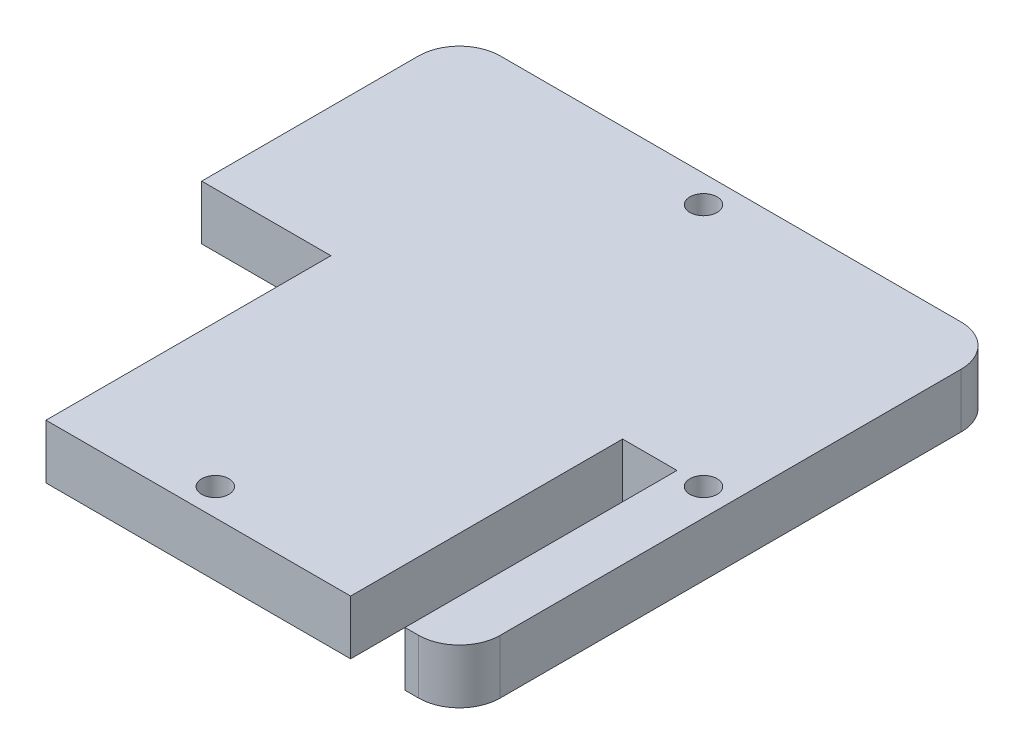
ISO-10303-21;
HEADER;
FILE_DESCRIPTION(('STEP AP214'),'2;1');
FILE_NAME('part.step','',(''),(''),'','','');
FILE_SCHEMA(('AUTOMOTIVE_DESIGN { 1 0 10303 214 1 1 1 1 }'));
ENDSEC;
DATA;
#1=APPLICATION_CONTEXT('core data for automotive mechanical design processes');
#2=APPLICATION_PROTOCOL_DEFINITION('international standard','automotive_design',2000,#1);
#3=PRODUCT_CONTEXT('',#1,'mechanical');
#4=PRODUCT('Part','Part','',(#3));
#5=PRODUCT_RELATED_PRODUCT_CATEGORY('part','',(#4));
#6=PRODUCT_DEFINITION_FORMATION('','',#4);
#7=PRODUCT_DEFINITION_CONTEXT('part definition',#1,'design');
#8=PRODUCT_DEFINITION('design','',#6,#7);
#9=PRODUCT_DEFINITION_SHAPE('','',#8);
#10=(LENGTH_UNIT() NAMED_UNIT(*) SI_UNIT(.MILLI.,.METRE.));
#11=(NAMED_UNIT(*) PLANE_ANGLE_UNIT() SI_UNIT($,.RADIAN.));
#12=(NAMED_UNIT(*) SI_UNIT($,.STERADIAN.) SOLID_ANGLE_UNIT());
#13=UNCERTAINTY_MEASURE_WITH_UNIT(LENGTH_MEASURE(1.E-05),#10,'distance_accuracy_value','');
#14=(GEOMETRIC_REPRESENTATION_CONTEXT(3) GLOBAL_UNCERTAINTY_ASSIGNED_CONTEXT((#13)) GLOBAL_UNIT_ASSIGNED_CONTEXT((#10,
#11,#12)) REPRESENTATION_CONTEXT('',''));
#15=CARTESIAN_POINT('',(0.,0.,0.));
#16=DIRECTION('',(0.,0.,1.));
#17=DIRECTION('',(1.,0.,0.));
#18=AXIS2_PLACEMENT_3D('',#15,#16,#17);
#19=CARTESIAN_POINT('',(0.,2.,19.95));
#20=DIRECTION('',(0.,0.,-1.));
#21=DIRECTION('',(-1.,0.,0.));
#22=AXIS2_PLACEMENT_3D('',#19,#20,#21);
#23=PLANE('',#22);
#24=DIRECTION('',(1.,0.,0.));
#25=VECTOR('',#24,1.);
#26=CARTESIAN_POINT('',(0.,-2.,19.95));
#27=LINE('',#26,#25);
#28=CARTESIAN_POINT('',(15.95,-2.,19.95));
#29=VERTEX_POINT('',#28);
#30=CARTESIAN_POINT('',(16.95,-2.,19.95));
#31=VERTEX_POINT('',#30);
#32=EDGE_CURVE('E171',#29,#31,#27,.T.);
#33=ORIENTED_EDGE('',*,*,#32,.T.);
#34=DIRECTION('',(0.,-1.,0.));
#35=VECTOR('',#34,1.);
#36=CARTESIAN_POINT('',(16.95,2.,19.95));
#37=LINE('',#36,#35);
#38=CARTESIAN_POINT('',(16.95,2.,19.95));
#39=VERTEX_POINT('',#38);
#40=EDGE_CURVE('E11',#31,#39,#37,.F.);
#41=ORIENTED_EDGE('',*,*,#40,.T.);
#42=DIRECTION('',(1.,0.,0.));
#43=VECTOR('',#42,1.);
#44=CARTESIAN_POINT('',(0.,2.,19.95));
#45=LINE('',#44,#43);
#46=CARTESIAN_POINT('',(15.95,2.,19.95));
#47=VERTEX_POINT('',#46);
#48=EDGE_CURVE('E250',#47,#39,#45,.T.);
#49=ORIENTED_EDGE('',*,*,#48,.F.);
#50=DIRECTION('',(0.,1.,0.));
#51=VECTOR('',#50,1.);
#52=CARTESIAN_POINT('',(15.95,-2.,19.95));
#53=LINE('',#52,#51);
#54=EDGE_CURVE('E245',#29,#47,#53,.T.);
#55=ORIENTED_EDGE('',*,*,#54,.F.);
#56=EDGE_LOOP('',(#33,#41,#49,#55));
#57=FACE_BOUND('',#56,.T.);
#58=ADVANCED_FACE('F49',(#57),#23,.F.);
#59=CARTESIAN_POINT('',(19.95,2.,0.));
#60=DIRECTION('',(1.,0.,0.));
#61=DIRECTION('',(0.,0.,-1.));
#62=AXIS2_PLACEMENT_3D('',#59,#60,#61);
#63=PLANE('',#62);
#64=DIRECTION('',(0.,0.,1.));
#65=VECTOR('',#64,1.);
#66=CARTESIAN_POINT('',(19.95,-2.,0.));
#67=LINE('',#66,#65);
#68=CARTESIAN_POINT('',(19.95,-2.,-16.95));
#69=VERTEX_POINT('',#68);
#70=CARTESIAN_POINT('',(19.95,-2.,16.95));
#71=VERTEX_POINT('',#70);
#72=EDGE_CURVE('E242',#69,#71,#67,.T.);
#73=ORIENTED_EDGE('',*,*,#72,.F.);
#74=DIRECTION('',(0.,-1.,0.));
#75=VECTOR('',#74,1.);
#76=CARTESIAN_POINT('',(19.95,2.,-16.95));
#77=LINE('',#76,#75);
#78=CARTESIAN_POINT('',(19.95,2.,-16.95));
#79=VERTEX_POINT('',#78);
#80=EDGE_CURVE('E217',#69,#79,#77,.F.);
#81=ORIENTED_EDGE('',*,*,#80,.T.);
#82=DIRECTION('',(0.,0.,1.));
#83=VECTOR('',#82,1.);
#84=CARTESIAN_POINT('',(19.95,2.,0.));
#85=LINE('',#84,#83);
#86=CARTESIAN_POINT('',(19.95,2.,16.95));
#87=VERTEX_POINT('',#86);
#88=EDGE_CURVE('E170',#79,#87,#85,.T.);
#89=ORIENTED_EDGE('',*,*,#88,.T.);
#90=DIRECTION('',(0.,-1.,0.));
#91=VECTOR('',#90,1.);
#92=CARTESIAN_POINT('',(19.95,-2.,16.95));
#93=LINE('',#92,#91);
#94=EDGE_CURVE('E213',#87,#71,#93,.T.);
#95=ORIENTED_EDGE('',*,*,#94,.T.);
#96=EDGE_LOOP('',(#73,#81,#89,#95));
#97=FACE_BOUND('',#96,.T.);
#98=ADVANCED_FACE('F325',(#97),#63,.T.);
#99=CARTESIAN_POINT('',(0.,2.,-19.95));
#100=DIRECTION('',(0.,0.,-1.));
#101=DIRECTION('',(-1.,0.,0.));
#102=AXIS2_PLACEMENT_3D('',#99,#100,#101);
#103=PLANE('',#102);
#104=DIRECTION('',(1.,0.,0.));
#105=VECTOR('',#104,1.);
#106=CARTESIAN_POINT('',(0.,2.,-19.95));
#107=LINE('',#106,#105);
#108=CARTESIAN_POINT('',(-16.95,2.,-19.95));
#109=VERTEX_POINT('',#108);
#110=CARTESIAN_POINT('',(16.95,2.,-19.95));
#111=VERTEX_POINT('',#110);
#112=EDGE_CURVE('E176',#109,#111,#107,.T.);
#113=ORIENTED_EDGE('',*,*,#112,.T.);
#114=DIRECTION('',(0.,-1.,0.));
#115=VECTOR('',#114,1.);
#116=CARTESIAN_POINT('',(16.95,2.,-19.95));
#117=LINE('',#116,#115);
#118=CARTESIAN_POINT('',(16.95,-2.,-19.95));
#119=VERTEX_POINT('',#118);
#120=EDGE_CURVE('E200',#111,#119,#117,.T.);
#121=ORIENTED_EDGE('',*,*,#120,.T.);
#122=DIRECTION('',(1.,0.,0.));
#123=VECTOR('',#122,1.);
#124=CARTESIAN_POINT('',(0.,-2.,-19.95));
#125=LINE('',#124,#123);
#126=CARTESIAN_POINT('',(-16.95,-2.,-19.95));
#127=VERTEX_POINT('',#126);
#128=EDGE_CURVE('E240',#127,#119,#125,.T.);
#129=ORIENTED_EDGE('',*,*,#128,.F.);
#130=DIRECTION('',(0.,-1.,0.));
#131=VECTOR('',#130,1.);
#132=CARTESIAN_POINT('',(-16.95,2.,-19.95));
#133=LINE('',#132,#131);
#134=EDGE_CURVE('E197',#127,#109,#133,.F.);
#135=ORIENTED_EDGE('',*,*,#134,.T.);
#136=EDGE_LOOP('',(#113,#121,#129,#135));
#137=FACE_BOUND('',#136,.T.);
#138=ADVANCED_FACE('F332',(#137),#103,.T.);
#139=CARTESIAN_POINT('',(-19.95,2.,0.));
#140=DIRECTION('',(1.,0.,0.));
#141=DIRECTION('',(0.,0.,-1.));
#142=AXIS2_PLACEMENT_3D('',#139,#140,#141);
#143=PLANE('',#142);
#144=DIRECTION('',(0.,0.,1.));
#145=VECTOR('',#144,1.);
#146=CARTESIAN_POINT('',(-19.95,-2.,0.));
#147=LINE('',#146,#145);
#148=CARTESIAN_POINT('',(-19.95,-2.,-16.95));
#149=VERTEX_POINT('',#148);
#150=CARTESIAN_POINT('',(-19.95,-2.,-1.));
#151=VERTEX_POINT('',#150);
#152=EDGE_CURVE('E179',#149,#151,#147,.T.);
#153=ORIENTED_EDGE('',*,*,#152,.T.);
#154=DIRECTION('',(0.,1.,0.));
#155=VECTOR('',#154,1.);
#156=CARTESIAN_POINT('',(-19.95,-2.,-1.));
#157=LINE('',#156,#155);
#158=CARTESIAN_POINT('',(-19.95,2.,-1.));
#159=VERTEX_POINT('',#158);
#160=EDGE_CURVE('E303',#151,#159,#157,.T.);
#161=ORIENTED_EDGE('',*,*,#160,.T.);
#162=DIRECTION('',(0.,0.,1.));
#163=VECTOR('',#162,1.);
#164=CARTESIAN_POINT('',(-19.95,2.,0.));
#165=LINE('',#164,#163);
#166=CARTESIAN_POINT('',(-19.95,2.,-16.95));
#167=VERTEX_POINT('',#166);
#168=EDGE_CURVE('E235',#167,#159,#165,.T.);
#169=ORIENTED_EDGE('',*,*,#168,.F.);
#170=DIRECTION('',(0.,-1.,0.));
#171=VECTOR('',#170,1.);
#172=CARTESIAN_POINT('',(-19.95,-2.,-16.95));
#173=LINE('',#172,#171);
#174=EDGE_CURVE('E58',#167,#149,#173,.T.);
#175=ORIENTED_EDGE('',*,*,#174,.T.);
#176=EDGE_LOOP('',(#153,#161,#169,#175));
#177=FACE_BOUND('',#176,.T.);
#178=ADVANCED_FACE('F233',(#177),#143,.F.);
#179=CARTESIAN_POINT('',(-10.45,2.,19.95));
#180=VERTEX_POINT('',#179);
#181=CARTESIAN_POINT('',(11.95,2.,19.95));
#182=VERTEX_POINT('',#181);
#183=EDGE_CURVE('E162',#180,#182,#45,.T.);
#184=ORIENTED_EDGE('',*,*,#183,.F.);
#185=DIRECTION('',(0.,1.,0.));
#186=VECTOR('',#185,1.);
#187=CARTESIAN_POINT('',(-10.45,-2.,19.95));
#188=LINE('',#187,#186);
#189=CARTESIAN_POINT('',(-10.45,-2.,19.95));
#190=VERTEX_POINT('',#189);
#191=EDGE_CURVE('E149',#190,#180,#188,.T.);
#192=ORIENTED_EDGE('',*,*,#191,.F.);
#193=CARTESIAN_POINT('',(11.95,-2.,19.95));
#194=VERTEX_POINT('',#193);
#195=EDGE_CURVE('E160',#190,#194,#27,.T.);
#196=ORIENTED_EDGE('',*,*,#195,.T.);
#197=DIRECTION('',(0.,1.,0.));
#198=VECTOR('',#197,1.);
#199=CARTESIAN_POINT('',(11.95,-2.,19.95));
#200=LINE('',#199,#198);
#201=EDGE_CURVE('E262',#194,#182,#200,.T.);
#202=ORIENTED_EDGE('',*,*,#201,.T.);
#203=EDGE_LOOP('',(#184,#192,#196,#202));
#204=FACE_BOUND('',#203,.T.);
#205=ADVANCED_FACE('F158',(#204),#23,.F.);
#206=CARTESIAN_POINT('',(0.,2.,0.));
#207=DIRECTION('',(0.,1.,0.));
#208=DIRECTION('',(0.,0.,1.));
#209=AXIS2_PLACEMENT_3D('',#206,#207,#208);
#210=PLANE('',#209);
#211=ORIENTED_EDGE('',*,*,#168,.T.);
#212=DIRECTION('',(-1.,0.,0.));
#213=VECTOR('',#212,1.);
#214=CARTESIAN_POINT('',(0.,2.,-1.));
#215=LINE('',#214,#213);
#216=CARTESIAN_POINT('',(-10.45,2.,-1.));
#217=VERTEX_POINT('',#216);
#218=EDGE_CURVE('E301',#217,#159,#215,.T.);
#219=ORIENTED_EDGE('',*,*,#218,.F.);
#220=DIRECTION('',(0.,0.,-1.));
#221=VECTOR('',#220,1.);
#222=CARTESIAN_POINT('',(-10.45,2.,0.));
#223=LINE('',#222,#221);
#224=EDGE_CURVE('E292',#180,#217,#223,.T.);
#225=ORIENTED_EDGE('',*,*,#224,.F.);
#226=ORIENTED_EDGE('',*,*,#183,.T.);
#227=DIRECTION('',(0.,0.,1.));
#228=VECTOR('',#227,1.);
#229=CARTESIAN_POINT('',(11.95,2.,19.95));
#230=LINE('',#229,#228);
#231=CARTESIAN_POINT('',(11.95,2.,-0.0500000000000009));
#232=VERTEX_POINT('',#231);
#233=EDGE_CURVE('E276',#232,#182,#230,.T.);
#234=ORIENTED_EDGE('',*,*,#233,.F.);
#235=DIRECTION('',(-1.,0.,0.));
#236=VECTOR('',#235,1.);
#237=CARTESIAN_POINT('',(15.95,2.,-0.0500000000000014));
#238=LINE('',#237,#236);
#239=CARTESIAN_POINT('',(15.95,2.,-0.0500000000000014));
#240=VERTEX_POINT('',#239);
#241=EDGE_CURVE('E280',#240,#232,#238,.T.);
#242=ORIENTED_EDGE('',*,*,#241,.F.);
#243=DIRECTION('',(0.,0.,-1.));
#244=VECTOR('',#243,1.);
#245=CARTESIAN_POINT('',(15.95,2.,19.95));
#246=LINE('',#245,#244);
#247=EDGE_CURVE('E196',#47,#240,#246,.T.);
#248=ORIENTED_EDGE('',*,*,#247,.F.);
#249=ORIENTED_EDGE('',*,*,#48,.T.);
#250=CARTESIAN_POINT('',(16.95,2.,16.95));
#251=DIRECTION('',(0.,1.,0.));
#252=DIRECTION('',(0.,0.,1.));
#253=AXIS2_PLACEMENT_3D('',#250,#251,#252);
#254=CIRCLE('',#253,3.);
#255=EDGE_CURVE('E220',#39,#87,#254,.T.);
#256=ORIENTED_EDGE('',*,*,#255,.T.);
#257=ORIENTED_EDGE('',*,*,#88,.F.);
#258=CARTESIAN_POINT('',(16.95,2.,-16.95));
#259=DIRECTION('',(0.,1.,0.));
#260=DIRECTION('',(0.,0.,1.));
#261=AXIS2_PLACEMENT_3D('',#258,#259,#260);
#262=CIRCLE('',#261,3.);
#263=EDGE_CURVE('E225',#79,#111,#262,.T.);
#264=ORIENTED_EDGE('',*,*,#263,.T.);
#265=ORIENTED_EDGE('',*,*,#112,.F.);
#266=CARTESIAN_POINT('',(-16.95,2.,-16.95));
#267=DIRECTION('',(0.,1.,0.));
#268=DIRECTION('',(0.,0.,1.));
#269=AXIS2_PLACEMENT_3D('',#266,#267,#268);
#270=CIRCLE('',#269,3.);
#271=EDGE_CURVE('E73',#109,#167,#270,.T.);
#272=ORIENTED_EDGE('',*,*,#271,.T.);
#273=EDGE_LOOP('',(#211,#219,#225,#226,#234,#242,#248,#249,#256,#257,#264,#265,#272));
#274=FACE_BOUND('',#273,.T.);
#275=CARTESIAN_POINT('',(0.,2.,17.95));
#276=DIRECTION('',(0.,-1.,0.));
#277=DIRECTION('',(0.,0.,-1.));
#278=AXIS2_PLACEMENT_3D('',#275,#276,#277);
#279=CIRCLE('',#278,1.);
#280=CARTESIAN_POINT('',(0.,2.,16.95));
#281=VERTEX_POINT('',#280);
#282=EDGE_CURVE('E188',#281,#281,#279,.T.);
#283=ORIENTED_EDGE('',*,*,#282,.T.);
#284=EDGE_LOOP('',(#283));
#285=FACE_BOUND('',#284,.T.);
#286=CARTESIAN_POINT('',(0.,2.,-17.95));
#287=DIRECTION('',(0.,-1.,0.));
#288=DIRECTION('',(0.,0.,-1.));
#289=AXIS2_PLACEMENT_3D('',#286,#287,#288);
#290=CIRCLE('',#289,1.);
#291=CARTESIAN_POINT('',(0.,2.,-18.95));
#292=VERTEX_POINT('',#291);
#293=EDGE_CURVE('E291',#292,#292,#290,.T.);
#294=ORIENTED_EDGE('',*,*,#293,.T.);
#295=EDGE_LOOP('',(#294));
#296=FACE_BOUND('',#295,.T.);
#297=CARTESIAN_POINT('',(17.95,2.,0.));
#298=DIRECTION('',(0.,-1.,0.));
#299=DIRECTION('',(0.,0.,-1.));
#300=AXIS2_PLACEMENT_3D('',#297,#298,#299);
#301=CIRCLE('',#300,1.);
#302=CARTESIAN_POINT('',(17.95,2.,-1.));
#303=VERTEX_POINT('',#302);
#304=EDGE_CURVE('E287',#303,#303,#301,.T.);
#305=ORIENTED_EDGE('',*,*,#304,.T.);
#306=EDGE_LOOP('',(#305));
#307=FACE_BOUND('',#306,.T.);
#308=ADVANCED_FACE('F311',(#274,#285,#296,#307),#210,.T.);
#309=CARTESIAN_POINT('',(0.,-2.,0.));
#310=DIRECTION('',(0.,1.,0.));
#311=DIRECTION('',(0.,0.,1.));
#312=AXIS2_PLACEMENT_3D('',#309,#310,#311);
#313=PLANE('',#312);
#314=CARTESIAN_POINT('',(0.,-2.,17.95));
#315=DIRECTION('',(0.,1.,0.));
#316=DIRECTION('',(0.,0.,1.));
#317=AXIS2_PLACEMENT_3D('',#314,#315,#316);
#318=CIRCLE('',#317,1.);
#319=CARTESIAN_POINT('',(0.,-2.,18.95));
#320=VERTEX_POINT('',#319);
#321=EDGE_CURVE('E192',#320,#320,#318,.T.);
#322=ORIENTED_EDGE('',*,*,#321,.T.);
#323=EDGE_LOOP('',(#322));
#324=FACE_BOUND('',#323,.T.);
#325=CARTESIAN_POINT('',(0.,-2.,-17.95));
#326=DIRECTION('',(0.,1.,0.));
#327=DIRECTION('',(0.,0.,1.));
#328=AXIS2_PLACEMENT_3D('',#325,#326,#327);
#329=CIRCLE('',#328,1.);
#330=CARTESIAN_POINT('',(0.,-2.,-16.95));
#331=VERTEX_POINT('',#330);
#332=EDGE_CURVE('E187',#331,#331,#329,.T.);
#333=ORIENTED_EDGE('',*,*,#332,.T.);
#334=EDGE_LOOP('',(#333));
#335=FACE_BOUND('',#334,.T.);
#336=CARTESIAN_POINT('',(17.95,-2.,0.));
#337=DIRECTION('',(0.,1.,0.));
#338=DIRECTION('',(0.,0.,1.));
#339=AXIS2_PLACEMENT_3D('',#336,#337,#338);
#340=CIRCLE('',#339,1.);
#341=CARTESIAN_POINT('',(17.95,-2.,1.));
#342=VERTEX_POINT('',#341);
#343=EDGE_CURVE('E183',#342,#342,#340,.T.);
#344=ORIENTED_EDGE('',*,*,#343,.T.);
#345=EDGE_LOOP('',(#344));
#346=FACE_BOUND('',#345,.T.);
#347=DIRECTION('',(-1.,0.,0.));
#348=VECTOR('',#347,1.);
#349=CARTESIAN_POINT('',(-19.95,-2.,-1.));
#350=LINE('',#349,#348);
#351=CARTESIAN_POINT('',(-10.45,-2.,-1.));
#352=VERTEX_POINT('',#351);
#353=EDGE_CURVE('E65',#352,#151,#350,.T.);
#354=ORIENTED_EDGE('',*,*,#353,.T.);
#355=ORIENTED_EDGE('',*,*,#152,.F.);
#356=CARTESIAN_POINT('',(-16.95,-2.,-16.95));
#357=DIRECTION('',(0.,1.,0.));
#358=DIRECTION('',(0.,0.,1.));
#359=AXIS2_PLACEMENT_3D('',#356,#357,#358);
#360=CIRCLE('',#359,3.);
#361=EDGE_CURVE('E207',#149,#127,#360,.F.);
#362=ORIENTED_EDGE('',*,*,#361,.T.);
#363=ORIENTED_EDGE('',*,*,#128,.T.);
#364=CARTESIAN_POINT('',(16.95,-2.,-16.95));
#365=DIRECTION('',(0.,1.,0.));
#366=DIRECTION('',(0.,0.,1.));
#367=AXIS2_PLACEMENT_3D('',#364,#365,#366);
#368=CIRCLE('',#367,3.);
#369=EDGE_CURVE('E210',#119,#69,#368,.F.);
#370=ORIENTED_EDGE('',*,*,#369,.T.);
#371=ORIENTED_EDGE('',*,*,#72,.T.);
#372=CARTESIAN_POINT('',(16.95,-2.,16.95));
#373=DIRECTION('',(0.,1.,0.));
#374=DIRECTION('',(0.,0.,1.));
#375=AXIS2_PLACEMENT_3D('',#372,#373,#374);
#376=CIRCLE('',#375,3.);
#377=EDGE_CURVE('E204',#71,#31,#376,.F.);
#378=ORIENTED_EDGE('',*,*,#377,.T.);
#379=ORIENTED_EDGE('',*,*,#32,.F.);
#380=DIRECTION('',(0.,0.,-1.));
#381=VECTOR('',#380,1.);
#382=CARTESIAN_POINT('',(15.95,-2.,19.95));
#383=LINE('',#382,#381);
#384=CARTESIAN_POINT('',(15.95,-2.,-0.0500000000000014));
#385=VERTEX_POINT('',#384);
#386=EDGE_CURVE('E272',#29,#385,#383,.T.);
#387=ORIENTED_EDGE('',*,*,#386,.T.);
#388=DIRECTION('',(-1.,0.,0.));
#389=VECTOR('',#388,1.);
#390=CARTESIAN_POINT('',(15.95,-2.,-0.0500000000000014));
#391=LINE('',#390,#389);
#392=CARTESIAN_POINT('',(11.95,-2.,-0.0500000000000009));
#393=VERTEX_POINT('',#392);
#394=EDGE_CURVE('E269',#385,#393,#391,.T.);
#395=ORIENTED_EDGE('',*,*,#394,.T.);
#396=DIRECTION('',(0.,0.,1.));
#397=VECTOR('',#396,1.);
#398=CARTESIAN_POINT('',(11.95,-2.,19.95));
#399=LINE('',#398,#397);
#400=EDGE_CURVE('E168',#393,#194,#399,.T.);
#401=ORIENTED_EDGE('',*,*,#400,.T.);
#402=ORIENTED_EDGE('',*,*,#195,.F.);
#403=DIRECTION('',(0.,0.,-1.));
#404=VECTOR('',#403,1.);
#405=CARTESIAN_POINT('',(-10.45,-2.,-1.));
#406=LINE('',#405,#404);
#407=EDGE_CURVE('E146',#190,#352,#406,.T.);
#408=ORIENTED_EDGE('',*,*,#407,.T.);
#409=EDGE_LOOP('',(#354,#355,#362,#363,#370,#371,#378,#379,#387,#395,#401,#402,#408));
#410=FACE_BOUND('',#409,.T.);
#411=ADVANCED_FACE('F166',(#324,#335,#346,#410),#313,.F.);
#412=CARTESIAN_POINT('',(15.95,-2.,19.95));
#413=DIRECTION('',(1.,0.,0.));
#414=DIRECTION('',(0.,0.,-1.));
#415=AXIS2_PLACEMENT_3D('',#412,#413,#414);
#416=PLANE('',#415);
#417=DIRECTION('',(0.,1.,0.));
#418=VECTOR('',#417,1.);
#419=CARTESIAN_POINT('',(15.95,-2.,-0.0500000000000014));
#420=LINE('',#419,#418);
#421=EDGE_CURVE('E256',#385,#240,#420,.T.);
#422=ORIENTED_EDGE('',*,*,#421,.F.);
#423=ORIENTED_EDGE('',*,*,#386,.F.);
#424=ORIENTED_EDGE('',*,*,#54,.T.);
#425=ORIENTED_EDGE('',*,*,#247,.T.);
#426=EDGE_LOOP('',(#422,#423,#424,#425));
#427=FACE_BOUND('',#426,.T.);
#428=ADVANCED_FACE('F371',(#427),#416,.F.);
#429=CARTESIAN_POINT('',(11.95,-2.,19.95));
#430=DIRECTION('',(-1.,0.,0.));
#431=DIRECTION('',(0.,0.,1.));
#432=AXIS2_PLACEMENT_3D('',#429,#430,#431);
#433=PLANE('',#432);
#434=ORIENTED_EDGE('',*,*,#201,.F.);
#435=ORIENTED_EDGE('',*,*,#400,.F.);
#436=DIRECTION('',(0.,1.,0.));
#437=VECTOR('',#436,1.);
#438=CARTESIAN_POINT('',(11.95,-2.,-0.0500000000000009));
#439=LINE('',#438,#437);
#440=EDGE_CURVE('E259',#393,#232,#439,.T.);
#441=ORIENTED_EDGE('',*,*,#440,.T.);
#442=ORIENTED_EDGE('',*,*,#233,.T.);
#443=EDGE_LOOP('',(#434,#435,#441,#442));
#444=FACE_BOUND('',#443,.T.);
#445=ADVANCED_FACE('F379',(#444),#433,.F.);
#446=CARTESIAN_POINT('',(15.95,-2.,-0.0500000000000014));
#447=DIRECTION('',(0.,0.,-1.));
#448=DIRECTION('',(-1.,0.,0.));
#449=AXIS2_PLACEMENT_3D('',#446,#447,#448);
#450=PLANE('',#449);
#451=ORIENTED_EDGE('',*,*,#440,.F.);
#452=ORIENTED_EDGE('',*,*,#394,.F.);
#453=ORIENTED_EDGE('',*,*,#421,.T.);
#454=ORIENTED_EDGE('',*,*,#241,.T.);
#455=EDGE_LOOP('',(#451,#452,#453,#454));
#456=FACE_BOUND('',#455,.T.);
#457=ADVANCED_FACE('F376',(#456),#450,.F.);
#458=CARTESIAN_POINT('',(17.95,2.,0.));
#459=DIRECTION('',(0.,-1.,0.));
#460=DIRECTION('',(0.,0.,-1.));
#461=AXIS2_PLACEMENT_3D('',#458,#459,#460);
#462=CYLINDRICAL_SURFACE('',#461,1.);
#463=ORIENTED_EDGE('',*,*,#304,.F.);
#464=EDGE_LOOP('',(#463));
#465=FACE_BOUND('',#464,.T.);
#466=ORIENTED_EDGE('',*,*,#343,.F.);
#467=EDGE_LOOP('',(#466));
#468=FACE_BOUND('',#467,.T.);
#469=ADVANCED_FACE('F386',(#465,#468),#462,.F.);
#470=CARTESIAN_POINT('',(0.,2.,-17.95));
#471=DIRECTION('',(0.,-1.,0.));
#472=DIRECTION('',(0.,0.,-1.));
#473=AXIS2_PLACEMENT_3D('',#470,#471,#472);
#474=CYLINDRICAL_SURFACE('',#473,1.);
#475=ORIENTED_EDGE('',*,*,#293,.F.);
#476=EDGE_LOOP('',(#475));
#477=FACE_BOUND('',#476,.T.);
#478=ORIENTED_EDGE('',*,*,#332,.F.);
#479=EDGE_LOOP('',(#478));
#480=FACE_BOUND('',#479,.T.);
#481=ADVANCED_FACE('F401',(#477,#480),#474,.F.);
#482=CARTESIAN_POINT('',(0.,2.,17.95));
#483=DIRECTION('',(0.,-1.,0.));
#484=DIRECTION('',(0.,0.,-1.));
#485=AXIS2_PLACEMENT_3D('',#482,#483,#484);
#486=CYLINDRICAL_SURFACE('',#485,1.);
#487=ORIENTED_EDGE('',*,*,#282,.F.);
#488=EDGE_LOOP('',(#487));
#489=FACE_BOUND('',#488,.T.);
#490=ORIENTED_EDGE('',*,*,#321,.F.);
#491=EDGE_LOOP('',(#490));
#492=FACE_BOUND('',#491,.T.);
#493=ADVANCED_FACE('F351',(#489,#492),#486,.F.);
#494=CARTESIAN_POINT('',(16.95,2.,-16.95));
#495=DIRECTION('',(0.,-1.,0.));
#496=DIRECTION('',(0.,0.,-1.));
#497=AXIS2_PLACEMENT_3D('',#494,#495,#496);
#498=CYLINDRICAL_SURFACE('',#497,3.);
#499=ORIENTED_EDGE('',*,*,#263,.F.);
#500=ORIENTED_EDGE('',*,*,#80,.F.);
#501=ORIENTED_EDGE('',*,*,#369,.F.);
#502=ORIENTED_EDGE('',*,*,#120,.F.);
#503=EDGE_LOOP('',(#499,#500,#501,#502));
#504=FACE_BOUND('',#503,.T.);
#505=ADVANCED_FACE('F349',(#504),#498,.T.);
#506=CARTESIAN_POINT('',(-16.95,2.,-16.95));
#507=DIRECTION('',(0.,1.,0.));
#508=DIRECTION('',(0.,0.,1.));
#509=AXIS2_PLACEMENT_3D('',#506,#507,#508);
#510=CYLINDRICAL_SURFACE('',#509,3.);
#511=ORIENTED_EDGE('',*,*,#271,.F.);
#512=ORIENTED_EDGE('',*,*,#134,.F.);
#513=ORIENTED_EDGE('',*,*,#361,.F.);
#514=ORIENTED_EDGE('',*,*,#174,.F.);
#515=EDGE_LOOP('',(#511,#512,#513,#514));
#516=FACE_BOUND('',#515,.T.);
#517=ADVANCED_FACE('F322',(#516),#510,.T.);
#518=CARTESIAN_POINT('',(16.95,2.,16.95));
#519=DIRECTION('',(0.,1.,0.));
#520=DIRECTION('',(0.,0.,1.));
#521=AXIS2_PLACEMENT_3D('',#518,#519,#520);
#522=CYLINDRICAL_SURFACE('',#521,3.);
#523=ORIENTED_EDGE('',*,*,#255,.F.);
#524=ORIENTED_EDGE('',*,*,#40,.F.);
#525=ORIENTED_EDGE('',*,*,#377,.F.);
#526=ORIENTED_EDGE('',*,*,#94,.F.);
#527=EDGE_LOOP('',(#523,#524,#525,#526));
#528=FACE_BOUND('',#527,.T.);
#529=ADVANCED_FACE('F51',(#528),#522,.T.);
#530=CARTESIAN_POINT('',(-19.95,-2.,-1.));
#531=DIRECTION('',(0.,0.,-1.));
#532=DIRECTION('',(-1.,0.,0.));
#533=AXIS2_PLACEMENT_3D('',#530,#531,#532);
#534=PLANE('',#533);
#535=ORIENTED_EDGE('',*,*,#218,.T.);
#536=ORIENTED_EDGE('',*,*,#160,.F.);
#537=ORIENTED_EDGE('',*,*,#353,.F.);
#538=DIRECTION('',(0.,1.,0.));
#539=VECTOR('',#538,1.);
#540=CARTESIAN_POINT('',(-10.45,-2.,-1.));
#541=LINE('',#540,#539);
#542=EDGE_CURVE('E151',#352,#217,#541,.T.);
#543=ORIENTED_EDGE('',*,*,#542,.T.);
#544=EDGE_LOOP('',(#535,#536,#537,#543));
#545=FACE_BOUND('',#544,.T.);
#546=ADVANCED_FACE('F313',(#545),#534,.F.);
#547=CARTESIAN_POINT('',(-10.45,-2.,-1.));
#548=DIRECTION('',(1.,0.,0.));
#549=DIRECTION('',(0.,0.,-1.));
#550=AXIS2_PLACEMENT_3D('',#547,#548,#549);
#551=PLANE('',#550);
#552=ORIENTED_EDGE('',*,*,#224,.T.);
#553=ORIENTED_EDGE('',*,*,#542,.F.);
#554=ORIENTED_EDGE('',*,*,#407,.F.);
#555=ORIENTED_EDGE('',*,*,#191,.T.);
#556=EDGE_LOOP('',(#552,#553,#554,#555));
#557=FACE_BOUND('',#556,.T.);
#558=ADVANCED_FACE('F148',(#557),#551,.F.);
#559=CLOSED_SHELL('',(#58,#98,#138,#178,#205,#308,#411,#428,#445,#457,#469,#481,#493,#505,#517,
#529,#546,#558));
#560=MANIFOLD_SOLID_BREP('B2',#559);
#561=ADVANCED_BREP_SHAPE_REPRESENTATION('',(#18,#560),#14);
#562=SHAPE_DEFINITION_REPRESENTATION(#9,#561);
ENDSEC;
END-ISO-10303-21;
